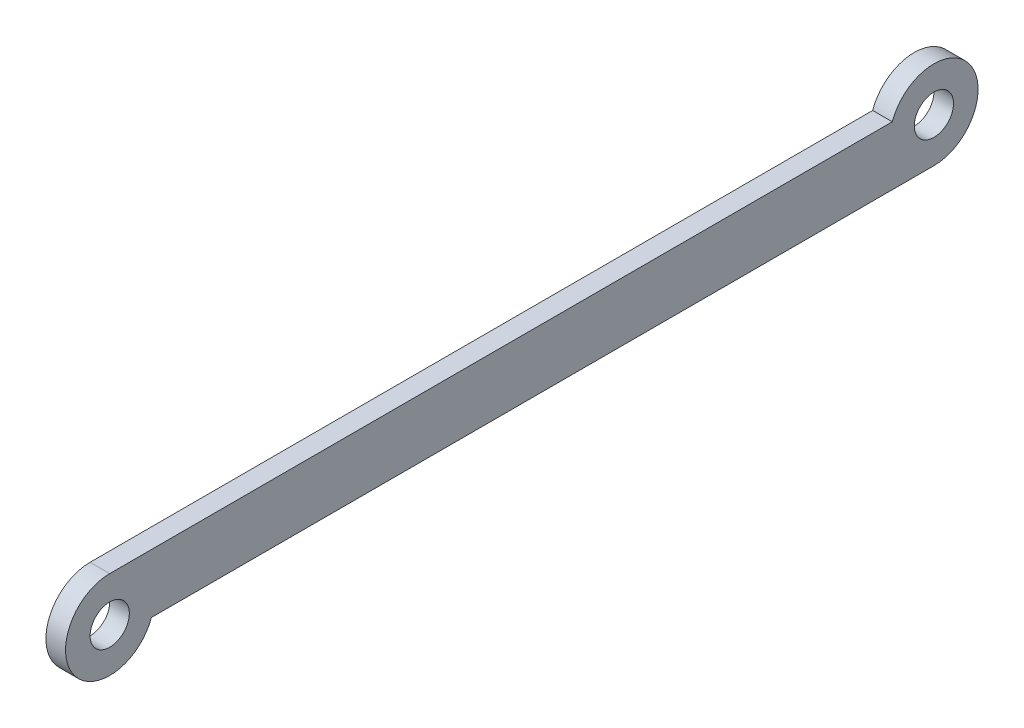
ISO-10303-21;
HEADER;
FILE_DESCRIPTION(('STEP AP214'),'2;1');
FILE_NAME('part.step','',(''),(''),'','','');
FILE_SCHEMA(('AUTOMOTIVE_DESIGN { 1 0 10303 214 1 1 1 1 }'));
ENDSEC;
DATA;
#1=APPLICATION_CONTEXT('core data for automotive mechanical design processes');
#2=APPLICATION_PROTOCOL_DEFINITION('international standard','automotive_design',2000,#1);
#3=PRODUCT_CONTEXT('',#1,'mechanical');
#4=PRODUCT('Part','Part','',(#3));
#5=PRODUCT_RELATED_PRODUCT_CATEGORY('part','',(#4));
#6=PRODUCT_DEFINITION_FORMATION('','',#4);
#7=PRODUCT_DEFINITION_CONTEXT('part definition',#1,'design');
#8=PRODUCT_DEFINITION('design','',#6,#7);
#9=PRODUCT_DEFINITION_SHAPE('','',#8);
#10=(LENGTH_UNIT() NAMED_UNIT(*) SI_UNIT(.MILLI.,.METRE.));
#11=(NAMED_UNIT(*) PLANE_ANGLE_UNIT() SI_UNIT($,.RADIAN.));
#12=(NAMED_UNIT(*) SI_UNIT($,.STERADIAN.) SOLID_ANGLE_UNIT());
#13=UNCERTAINTY_MEASURE_WITH_UNIT(LENGTH_MEASURE(1.E-05),#10,'distance_accuracy_value','');
#14=(GEOMETRIC_REPRESENTATION_CONTEXT(3) GLOBAL_UNCERTAINTY_ASSIGNED_CONTEXT((#13)) GLOBAL_UNIT_ASSIGNED_CONTEXT((#10,
#11,#12)) REPRESENTATION_CONTEXT('',''));
#15=CARTESIAN_POINT('',(0.,0.,0.));
#16=DIRECTION('',(0.,0.,1.));
#17=DIRECTION('',(1.,0.,0.));
#18=AXIS2_PLACEMENT_3D('',#15,#16,#17);
#19=CARTESIAN_POINT('',(0.,0.,0.));
#20=DIRECTION('',(1.,0.,0.));
#21=DIRECTION('',(0.,0.,-1.));
#22=AXIS2_PLACEMENT_3D('',#19,#20,#21);
#23=PLANE('',#22);
#24=CARTESIAN_POINT('',(0.,1.5,-42.));
#25=DIRECTION('',(1.,0.,0.));
#26=DIRECTION('',(0.,0.,-1.));
#27=AXIS2_PLACEMENT_3D('',#24,#25,#26);
#28=CIRCLE('',#27,2.25);
#29=CARTESIAN_POINT('',(0.,2.25,-39.8786796564404));
#30=VERTEX_POINT('',#29);
#31=CARTESIAN_POINT('',(0.,-0.750000000000001,-42.));
#32=VERTEX_POINT('',#31);
#33=EDGE_CURVE('E58',#30,#32,#28,.F.);
#34=ORIENTED_EDGE('',*,*,#33,.F.);
#35=DIRECTION('',(0.,0.,1.));
#36=VECTOR('',#35,1.);
#37=CARTESIAN_POINT('',(0.,2.25,0.));
#38=LINE('',#37,#36);
#39=CARTESIAN_POINT('',(0.,2.25,0.));
#40=VERTEX_POINT('',#39);
#41=EDGE_CURVE('E53',#40,#30,#38,.F.);
#42=ORIENTED_EDGE('',*,*,#41,.F.);
#43=CARTESIAN_POINT('',(0.,0.,0.));
#44=DIRECTION('',(1.,0.,0.));
#45=DIRECTION('',(0.,0.,-1.));
#46=AXIS2_PLACEMENT_3D('',#43,#44,#45);
#47=CIRCLE('',#46,2.25);
#48=CARTESIAN_POINT('',(0.,-0.750000000000004,-2.12132034355964));
#49=VERTEX_POINT('',#48);
#50=EDGE_CURVE('E70',#49,#40,#47,.F.);
#51=ORIENTED_EDGE('',*,*,#50,.F.);
#52=DIRECTION('',(0.,0.,-1.));
#53=VECTOR('',#52,1.);
#54=CARTESIAN_POINT('',(0.,-0.75,-42.));
#55=LINE('',#54,#53);
#56=EDGE_CURVE('E68',#32,#49,#55,.F.);
#57=ORIENTED_EDGE('',*,*,#56,.F.);
#58=EDGE_LOOP('',(#34,#42,#51,#57));
#59=FACE_BOUND('',#58,.T.);
#60=CARTESIAN_POINT('',(0.,0.,0.));
#61=DIRECTION('',(1.,0.,0.));
#62=DIRECTION('',(0.,0.,-1.));
#63=AXIS2_PLACEMENT_3D('',#60,#61,#62);
#64=CIRCLE('',#63,1.);
#65=CARTESIAN_POINT('',(0.,0.,-1.));
#66=VERTEX_POINT('',#65);
#67=EDGE_CURVE('E74',#66,#66,#64,.F.);
#68=ORIENTED_EDGE('',*,*,#67,.T.);
#69=EDGE_LOOP('',(#68));
#70=FACE_BOUND('',#69,.T.);
#71=CARTESIAN_POINT('',(0.,1.5,-42.));
#72=DIRECTION('',(1.,0.,0.));
#73=DIRECTION('',(0.,0.,-1.));
#74=AXIS2_PLACEMENT_3D('',#71,#72,#73);
#75=CIRCLE('',#74,1.);
#76=CARTESIAN_POINT('',(0.,1.5,-43.));
#77=VERTEX_POINT('',#76);
#78=EDGE_CURVE('E19',#77,#77,#75,.F.);
#79=ORIENTED_EDGE('',*,*,#78,.T.);
#80=EDGE_LOOP('',(#79));
#81=FACE_BOUND('',#80,.T.);
#82=ADVANCED_FACE('F16',(#59,#70,#81),#23,.T.);
#83=CARTESIAN_POINT('',(-1.,1.5,-42.));
#84=DIRECTION('',(1.,0.,0.));
#85=DIRECTION('',(0.,0.,-1.));
#86=AXIS2_PLACEMENT_3D('',#83,#84,#85);
#87=CYLINDRICAL_SURFACE('',#86,1.);
#88=CARTESIAN_POINT('',(-1.,1.5,-42.));
#89=DIRECTION('',(1.,0.,0.));
#90=DIRECTION('',(0.,0.,-1.));
#91=AXIS2_PLACEMENT_3D('',#88,#89,#90);
#92=CIRCLE('',#91,1.);
#93=CARTESIAN_POINT('',(-1.,1.5,-43.));
#94=VERTEX_POINT('',#93);
#95=EDGE_CURVE('E89',#94,#94,#92,.F.);
#96=ORIENTED_EDGE('',*,*,#95,.T.);
#97=EDGE_LOOP('',(#96));
#98=FACE_BOUND('',#97,.T.);
#99=ORIENTED_EDGE('',*,*,#78,.F.);
#100=EDGE_LOOP('',(#99));
#101=FACE_BOUND('',#100,.T.);
#102=ADVANCED_FACE('F99',(#98,#101),#87,.F.);
#103=CARTESIAN_POINT('',(-1.,0.,0.));
#104=DIRECTION('',(1.,0.,0.));
#105=DIRECTION('',(0.,0.,-1.));
#106=AXIS2_PLACEMENT_3D('',#103,#104,#105);
#107=CYLINDRICAL_SURFACE('',#106,1.);
#108=CARTESIAN_POINT('',(-1.,0.,0.));
#109=DIRECTION('',(1.,0.,0.));
#110=DIRECTION('',(0.,0.,-1.));
#111=AXIS2_PLACEMENT_3D('',#108,#109,#110);
#112=CIRCLE('',#111,1.);
#113=CARTESIAN_POINT('',(-1.,0.,-1.));
#114=VERTEX_POINT('',#113);
#115=EDGE_CURVE('E86',#114,#114,#112,.F.);
#116=ORIENTED_EDGE('',*,*,#115,.T.);
#117=EDGE_LOOP('',(#116));
#118=FACE_BOUND('',#117,.T.);
#119=ORIENTED_EDGE('',*,*,#67,.F.);
#120=EDGE_LOOP('',(#119));
#121=FACE_BOUND('',#120,.T.);
#122=ADVANCED_FACE('F101',(#118,#121),#107,.F.);
#123=CARTESIAN_POINT('',(-1.,-0.75,-42.));
#124=DIRECTION('',(0.,-1.,0.));
#125=DIRECTION('',(0.,0.,-1.));
#126=AXIS2_PLACEMENT_3D('',#123,#124,#125);
#127=PLANE('',#126);
#128=DIRECTION('',(0.,0.,-1.));
#129=VECTOR('',#128,1.);
#130=CARTESIAN_POINT('',(-1.,-0.750000000000004,0.));
#131=LINE('',#130,#129);
#132=CARTESIAN_POINT('',(-1.,-0.750000000000004,-2.12132034355964));
#133=VERTEX_POINT('',#132);
#134=CARTESIAN_POINT('',(-1.,-0.750000000000003,-42.));
#135=VERTEX_POINT('',#134);
#136=EDGE_CURVE('E78',#133,#135,#131,.T.);
#137=ORIENTED_EDGE('',*,*,#136,.T.);
#138=DIRECTION('',(1.,0.,0.));
#139=VECTOR('',#138,1.);
#140=CARTESIAN_POINT('',(-1.,-0.750000000000002,-42.));
#141=LINE('',#140,#139);
#142=EDGE_CURVE('E62',#32,#135,#141,.F.);
#143=ORIENTED_EDGE('',*,*,#142,.F.);
#144=ORIENTED_EDGE('',*,*,#56,.T.);
#145=DIRECTION('',(1.,0.,0.));
#146=VECTOR('',#145,1.);
#147=CARTESIAN_POINT('',(-1.,-0.750000000000004,-2.12132034355964));
#148=LINE('',#147,#146);
#149=EDGE_CURVE('E92',#133,#49,#148,.T.);
#150=ORIENTED_EDGE('',*,*,#149,.F.);
#151=EDGE_LOOP('',(#137,#143,#144,#150));
#152=FACE_BOUND('',#151,.T.);
#153=ADVANCED_FACE('F77',(#152),#127,.T.);
#154=CARTESIAN_POINT('',(-1.,1.5,-42.));
#155=DIRECTION('',(1.,0.,0.));
#156=DIRECTION('',(0.,0.,-1.));
#157=AXIS2_PLACEMENT_3D('',#154,#155,#156);
#158=CYLINDRICAL_SURFACE('',#157,2.25);
#159=DIRECTION('',(1.,0.,0.));
#160=VECTOR('',#159,1.);
#161=CARTESIAN_POINT('',(-1.,2.25,-39.8786796564404));
#162=LINE('',#161,#160);
#163=CARTESIAN_POINT('',(-1.,2.25,-39.8786796564404));
#164=VERTEX_POINT('',#163);
#165=EDGE_CURVE('E64',#30,#164,#162,.F.);
#166=ORIENTED_EDGE('',*,*,#165,.F.);
#167=ORIENTED_EDGE('',*,*,#33,.T.);
#168=ORIENTED_EDGE('',*,*,#142,.T.);
#169=CARTESIAN_POINT('',(-1.,1.5,-42.));
#170=DIRECTION('',(1.,0.,0.));
#171=DIRECTION('',(0.,0.,-1.));
#172=AXIS2_PLACEMENT_3D('',#169,#170,#171);
#173=CIRCLE('',#172,2.25);
#174=EDGE_CURVE('E84',#135,#164,#173,.T.);
#175=ORIENTED_EDGE('',*,*,#174,.T.);
#176=EDGE_LOOP('',(#166,#167,#168,#175));
#177=FACE_BOUND('',#176,.T.);
#178=ADVANCED_FACE('F60',(#177),#158,.T.);
#179=CARTESIAN_POINT('',(-1.,2.25,0.));
#180=DIRECTION('',(0.,1.,0.));
#181=DIRECTION('',(0.,0.,1.));
#182=AXIS2_PLACEMENT_3D('',#179,#180,#181);
#183=PLANE('',#182);
#184=DIRECTION('',(0.,0.,-1.));
#185=VECTOR('',#184,1.);
#186=CARTESIAN_POINT('',(-1.,2.25,0.));
#187=LINE('',#186,#185);
#188=CARTESIAN_POINT('',(-1.,2.25,0.));
#189=VERTEX_POINT('',#188);
#190=EDGE_CURVE('E25',#164,#189,#187,.F.);
#191=ORIENTED_EDGE('',*,*,#190,.T.);
#192=DIRECTION('',(1.,0.,0.));
#193=VECTOR('',#192,1.);
#194=CARTESIAN_POINT('',(-1.,2.25,0.));
#195=LINE('',#194,#193);
#196=EDGE_CURVE('E33',#40,#189,#195,.F.);
#197=ORIENTED_EDGE('',*,*,#196,.F.);
#198=ORIENTED_EDGE('',*,*,#41,.T.);
#199=ORIENTED_EDGE('',*,*,#165,.T.);
#200=EDGE_LOOP('',(#191,#197,#198,#199));
#201=FACE_BOUND('',#200,.T.);
#202=ADVANCED_FACE('F119',(#201),#183,.T.);
#203=CARTESIAN_POINT('',(-1.,0.,0.));
#204=DIRECTION('',(1.,0.,0.));
#205=DIRECTION('',(0.,0.,-1.));
#206=AXIS2_PLACEMENT_3D('',#203,#204,#205);
#207=CYLINDRICAL_SURFACE('',#206,2.25);
#208=CARTESIAN_POINT('',(-1.,0.,0.));
#209=DIRECTION('',(1.,0.,0.));
#210=DIRECTION('',(0.,0.,-1.));
#211=AXIS2_PLACEMENT_3D('',#208,#209,#210);
#212=CIRCLE('',#211,2.25);
#213=EDGE_CURVE('E11',#189,#133,#212,.T.);
#214=ORIENTED_EDGE('',*,*,#213,.T.);
#215=ORIENTED_EDGE('',*,*,#149,.T.);
#216=ORIENTED_EDGE('',*,*,#50,.T.);
#217=ORIENTED_EDGE('',*,*,#196,.T.);
#218=EDGE_LOOP('',(#214,#215,#216,#217));
#219=FACE_BOUND('',#218,.T.);
#220=ADVANCED_FACE('F113',(#219),#207,.T.);
#221=CARTESIAN_POINT('',(-1.,0.,0.));
#222=DIRECTION('',(1.,0.,0.));
#223=DIRECTION('',(0.,0.,-1.));
#224=AXIS2_PLACEMENT_3D('',#221,#222,#223);
#225=PLANE('',#224);
#226=ORIENTED_EDGE('',*,*,#190,.F.);
#227=ORIENTED_EDGE('',*,*,#174,.F.);
#228=ORIENTED_EDGE('',*,*,#136,.F.);
#229=ORIENTED_EDGE('',*,*,#213,.F.);
#230=EDGE_LOOP('',(#226,#227,#228,#229));
#231=FACE_BOUND('',#230,.T.);
#232=ORIENTED_EDGE('',*,*,#115,.F.);
#233=EDGE_LOOP('',(#232));
#234=FACE_BOUND('',#233,.T.);
#235=ORIENTED_EDGE('',*,*,#95,.F.);
#236=EDGE_LOOP('',(#235));
#237=FACE_BOUND('',#236,.T.);
#238=ADVANCED_FACE('F111',(#231,#234,#237),#225,.F.);
#239=CLOSED_SHELL('',(#82,#102,#122,#153,#178,#202,#220,#238));
#240=MANIFOLD_SOLID_BREP('B1',#239);
#241=ADVANCED_BREP_SHAPE_REPRESENTATION('',(#18,#240),#14);
#242=SHAPE_DEFINITION_REPRESENTATION(#9,#241);
ENDSEC;
END-ISO-10303-21;
